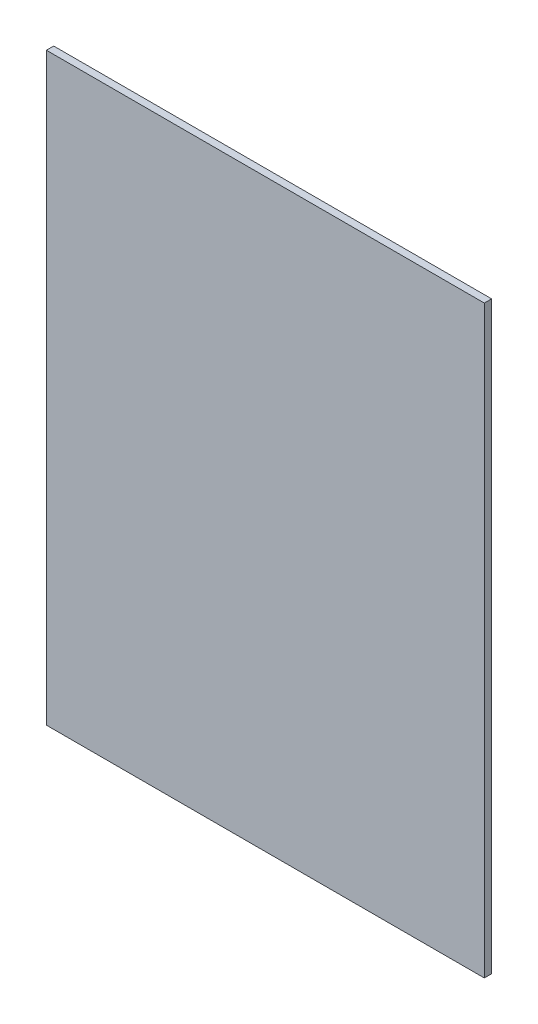
ISO-10303-21;
HEADER;
FILE_DESCRIPTION(('STEP AP214'),'2;1');
FILE_NAME('part.step','',(''),(''),'','','');
FILE_SCHEMA(('AUTOMOTIVE_DESIGN { 1 0 10303 214 1 1 1 1 }'));
ENDSEC;
DATA;
#1=APPLICATION_CONTEXT('core data for automotive mechanical design processes');
#2=APPLICATION_PROTOCOL_DEFINITION('international standard','automotive_design',2000,#1);
#3=PRODUCT_CONTEXT('',#1,'mechanical');
#4=PRODUCT('Part','Part','',(#3));
#5=PRODUCT_RELATED_PRODUCT_CATEGORY('part','',(#4));
#6=PRODUCT_DEFINITION_FORMATION('','',#4);
#7=PRODUCT_DEFINITION_CONTEXT('part definition',#1,'design');
#8=PRODUCT_DEFINITION('design','',#6,#7);
#9=PRODUCT_DEFINITION_SHAPE('','',#8);
#10=(LENGTH_UNIT() NAMED_UNIT(*) SI_UNIT(.MILLI.,.METRE.));
#11=(NAMED_UNIT(*) PLANE_ANGLE_UNIT() SI_UNIT($,.RADIAN.));
#12=(NAMED_UNIT(*) SI_UNIT($,.STERADIAN.) SOLID_ANGLE_UNIT());
#13=UNCERTAINTY_MEASURE_WITH_UNIT(LENGTH_MEASURE(1.E-05),#10,'distance_accuracy_value','');
#14=(GEOMETRIC_REPRESENTATION_CONTEXT(3) GLOBAL_UNCERTAINTY_ASSIGNED_CONTEXT((#13)) GLOBAL_UNIT_ASSIGNED_CONTEXT((#10,
#11,#12)) REPRESENTATION_CONTEXT('',''));
#15=CARTESIAN_POINT('',(0.,0.,0.));
#16=DIRECTION('',(0.,0.,1.));
#17=DIRECTION('',(1.,0.,0.));
#18=AXIS2_PLACEMENT_3D('',#15,#16,#17);
#19=CARTESIAN_POINT('',(0.29972,0.40005,0.));
#20=DIRECTION('',(0.,-1.,0.));
#21=DIRECTION('',(-1.,0.,0.));
#22=AXIS2_PLACEMENT_3D('',#19,#20,#21);
#23=PLANE('',#22);
#24=DIRECTION('',(-1.,0.,0.));
#25=VECTOR('',#24,1.);
#26=CARTESIAN_POINT('',(0.29972,0.40005,0.));
#27=LINE('',#26,#25);
#28=CARTESIAN_POINT('',(0.29972,0.40005,0.));
#29=VERTEX_POINT('',#28);
#30=CARTESIAN_POINT('',(-0.29971746,0.40005,0.));
#31=VERTEX_POINT('',#30);
#32=EDGE_CURVE('E11',#29,#31,#27,.T.);
#33=ORIENTED_EDGE('',*,*,#32,.T.);
#34=DIRECTION('',(0.,0.,1.));
#35=VECTOR('',#34,1.);
#36=CARTESIAN_POINT('',(-0.29971746,0.40005,0.));
#37=LINE('',#36,#35);
#38=CARTESIAN_POINT('',(-0.29971746,0.40005,0.00999998));
#39=VERTEX_POINT('',#38);
#40=EDGE_CURVE('E25',#31,#39,#37,.T.);
#41=ORIENTED_EDGE('',*,*,#40,.T.);
#42=DIRECTION('',(-1.,0.,0.));
#43=VECTOR('',#42,1.);
#44=CARTESIAN_POINT('',(0.29972,0.40005,0.00999998));
#45=LINE('',#44,#43);
#46=CARTESIAN_POINT('',(0.29972,0.40005,0.00999998));
#47=VERTEX_POINT('',#46);
#48=EDGE_CURVE('E96',#47,#39,#45,.T.);
#49=ORIENTED_EDGE('',*,*,#48,.F.);
#50=DIRECTION('',(0.,0.,1.));
#51=VECTOR('',#50,1.);
#52=CARTESIAN_POINT('',(0.29972,0.40005,0.));
#53=LINE('',#52,#51);
#54=EDGE_CURVE('E91',#29,#47,#53,.T.);
#55=ORIENTED_EDGE('',*,*,#54,.F.);
#56=EDGE_LOOP('',(#33,#41,#49,#55));
#57=FACE_BOUND('',#56,.T.);
#58=ADVANCED_FACE('F17',(#57),#23,.F.);
#59=CARTESIAN_POINT('',(0.29972,-0.40005,0.));
#60=DIRECTION('',(-1.,0.,0.));
#61=DIRECTION('',(0.,1.,0.));
#62=AXIS2_PLACEMENT_3D('',#59,#60,#61);
#63=PLANE('',#62);
#64=DIRECTION('',(0.,1.,0.));
#65=VECTOR('',#64,1.);
#66=CARTESIAN_POINT('',(0.29972,-0.40005,0.));
#67=LINE('',#66,#65);
#68=CARTESIAN_POINT('',(0.29972,-0.40005,0.));
#69=VERTEX_POINT('',#68);
#70=EDGE_CURVE('E73',#69,#29,#67,.T.);
#71=ORIENTED_EDGE('',*,*,#70,.T.);
#72=ORIENTED_EDGE('',*,*,#54,.T.);
#73=DIRECTION('',(0.,1.,0.));
#74=VECTOR('',#73,1.);
#75=CARTESIAN_POINT('',(0.29972,-0.40005,0.00999998));
#76=LINE('',#75,#74);
#77=CARTESIAN_POINT('',(0.29972,-0.40005,0.00999998));
#78=VERTEX_POINT('',#77);
#79=EDGE_CURVE('E76',#78,#47,#76,.T.);
#80=ORIENTED_EDGE('',*,*,#79,.F.);
#81=DIRECTION('',(0.,0.,1.));
#82=VECTOR('',#81,1.);
#83=CARTESIAN_POINT('',(0.29972,-0.40005,0.));
#84=LINE('',#83,#82);
#85=EDGE_CURVE('E74',#69,#78,#84,.T.);
#86=ORIENTED_EDGE('',*,*,#85,.F.);
#87=EDGE_LOOP('',(#71,#72,#80,#86));
#88=FACE_BOUND('',#87,.T.);
#89=ADVANCED_FACE('F108',(#88),#63,.F.);
#90=CARTESIAN_POINT('',(-0.29971492,-0.40005,0.));
#91=DIRECTION('',(0.,1.,0.));
#92=DIRECTION('',(1.,0.,0.));
#93=AXIS2_PLACEMENT_3D('',#90,#91,#92);
#94=PLANE('',#93);
#95=DIRECTION('',(1.,0.,0.));
#96=VECTOR('',#95,1.);
#97=CARTESIAN_POINT('',(-0.29971492,-0.40005,0.));
#98=LINE('',#97,#96);
#99=CARTESIAN_POINT('',(-0.29971492,-0.40005,0.));
#100=VERTEX_POINT('',#99);
#101=EDGE_CURVE('E59',#100,#69,#98,.T.);
#102=ORIENTED_EDGE('',*,*,#101,.T.);
#103=ORIENTED_EDGE('',*,*,#85,.T.);
#104=DIRECTION('',(1.,0.,0.));
#105=VECTOR('',#104,1.);
#106=CARTESIAN_POINT('',(-0.29971492,-0.40005,0.00999998));
#107=LINE('',#106,#105);
#108=CARTESIAN_POINT('',(-0.29971492,-0.40005,0.00999998));
#109=VERTEX_POINT('',#108);
#110=EDGE_CURVE('E62',#109,#78,#107,.T.);
#111=ORIENTED_EDGE('',*,*,#110,.F.);
#112=DIRECTION('',(0.,0.,1.));
#113=VECTOR('',#112,1.);
#114=CARTESIAN_POINT('',(-0.29971492,-0.40005,0.));
#115=LINE('',#114,#113);
#116=EDGE_CURVE('E54',#100,#109,#115,.T.);
#117=ORIENTED_EDGE('',*,*,#116,.F.);
#118=EDGE_LOOP('',(#102,#103,#111,#117));
#119=FACE_BOUND('',#118,.T.);
#120=ADVANCED_FACE('F56',(#119),#94,.F.);
#121=CARTESIAN_POINT('',(-0.29971746,0.40005,0.));
#122=DIRECTION('',(0.999999999994961,3.17460313531188E-06,0.));
#123=DIRECTION('',(3.17460313531188E-06,-0.999999999994961,0.));
#124=AXIS2_PLACEMENT_3D('',#121,#122,#123);
#125=PLANE('',#124);
#126=DIRECTION('',(3.17460313531188E-06,-0.999999999994961,0.));
#127=VECTOR('',#126,1.);
#128=CARTESIAN_POINT('',(-0.29971746,0.40005,0.));
#129=LINE('',#128,#127);
#130=EDGE_CURVE('E65',#31,#100,#129,.T.);
#131=ORIENTED_EDGE('',*,*,#130,.T.);
#132=ORIENTED_EDGE('',*,*,#116,.T.);
#133=DIRECTION('',(3.17460313531188E-06,-0.999999999994961,0.));
#134=VECTOR('',#133,1.);
#135=CARTESIAN_POINT('',(-0.29971746,0.40005,0.00999998));
#136=LINE('',#135,#134);
#137=EDGE_CURVE('E69',#39,#109,#136,.T.);
#138=ORIENTED_EDGE('',*,*,#137,.F.);
#139=ORIENTED_EDGE('',*,*,#40,.F.);
#140=EDGE_LOOP('',(#131,#132,#138,#139));
#141=FACE_BOUND('',#140,.T.);
#142=ADVANCED_FACE('F67',(#141),#125,.F.);
#143=CARTESIAN_POINT('',(1.904999025326E-06,3.630227623424E-07,0.00999998));
#144=DIRECTION('',(0.,0.,1.));
#145=DIRECTION('',(1.,0.,0.));
#146=AXIS2_PLACEMENT_3D('',#143,#144,#145);
#147=PLANE('',#146);
#148=ORIENTED_EDGE('',*,*,#48,.T.);
#149=ORIENTED_EDGE('',*,*,#137,.T.);
#150=ORIENTED_EDGE('',*,*,#110,.T.);
#151=ORIENTED_EDGE('',*,*,#79,.T.);
#152=EDGE_LOOP('',(#148,#149,#150,#151));
#153=FACE_BOUND('',#152,.T.);
#154=ADVANCED_FACE('F106',(#153),#147,.T.);
#155=CARTESIAN_POINT('',(1.904999025326E-06,3.630227623424E-07,0.));
#156=DIRECTION('',(0.,0.,1.));
#157=DIRECTION('',(1.,0.,0.));
#158=AXIS2_PLACEMENT_3D('',#155,#156,#157);
#159=PLANE('',#158);
#160=ORIENTED_EDGE('',*,*,#70,.F.);
#161=ORIENTED_EDGE('',*,*,#101,.F.);
#162=ORIENTED_EDGE('',*,*,#130,.F.);
#163=ORIENTED_EDGE('',*,*,#32,.F.);
#164=EDGE_LOOP('',(#160,#161,#162,#163));
#165=FACE_BOUND('',#164,.T.);
#166=ADVANCED_FACE('F71',(#165),#159,.F.);
#167=CLOSED_SHELL('',(#58,#89,#120,#142,#154,#166));
#168=MANIFOLD_SOLID_BREP('B1',#167);
#169=ADVANCED_BREP_SHAPE_REPRESENTATION('',(#18,#168),#14);
#170=SHAPE_DEFINITION_REPRESENTATION(#9,#169);
ENDSEC;
END-ISO-10303-21;
